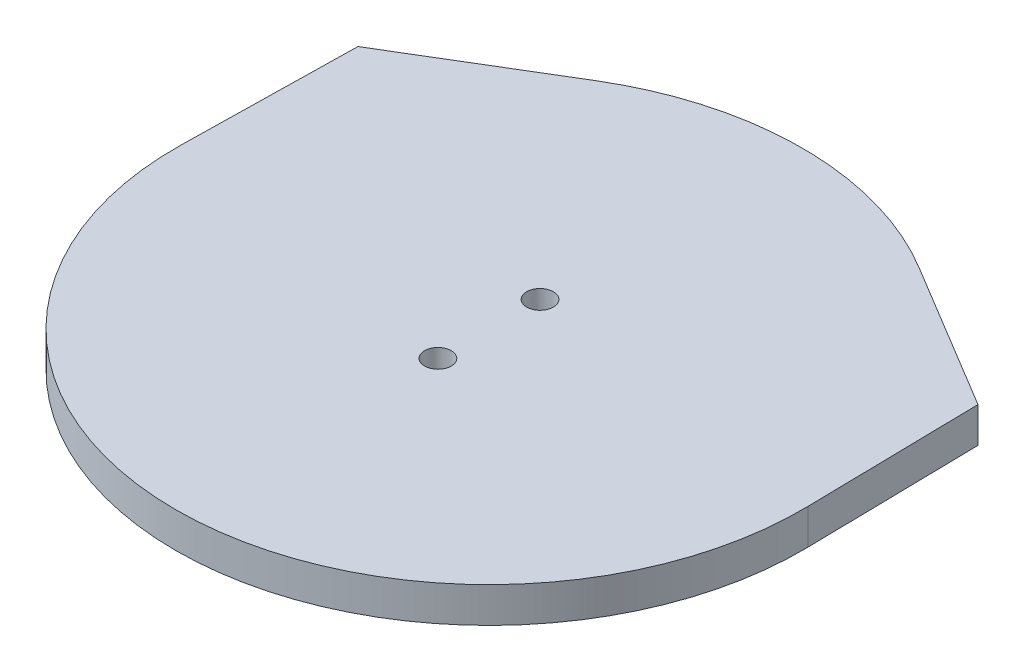
ISO-10303-21;
HEADER;
FILE_DESCRIPTION(('STEP AP214'),'2;1');
FILE_NAME('part.step','',(''),(''),'','','');
FILE_SCHEMA(('AUTOMOTIVE_DESIGN { 1 0 10303 214 1 1 1 1 }'));
ENDSEC;
DATA;
#1=APPLICATION_CONTEXT('core data for automotive mechanical design processes');
#2=APPLICATION_PROTOCOL_DEFINITION('international standard','automotive_design',2000,#1);
#3=PRODUCT_CONTEXT('',#1,'mechanical');
#4=PRODUCT('Part','Part','',(#3));
#5=PRODUCT_RELATED_PRODUCT_CATEGORY('part','',(#4));
#6=PRODUCT_DEFINITION_FORMATION('','',#4);
#7=PRODUCT_DEFINITION_CONTEXT('part definition',#1,'design');
#8=PRODUCT_DEFINITION('design','',#6,#7);
#9=PRODUCT_DEFINITION_SHAPE('','',#8);
#10=(LENGTH_UNIT() NAMED_UNIT(*) SI_UNIT(.MILLI.,.METRE.));
#11=(NAMED_UNIT(*) PLANE_ANGLE_UNIT() SI_UNIT($,.RADIAN.));
#12=(NAMED_UNIT(*) SI_UNIT($,.STERADIAN.) SOLID_ANGLE_UNIT());
#13=UNCERTAINTY_MEASURE_WITH_UNIT(LENGTH_MEASURE(1.E-05),#10,'distance_accuracy_value','');
#14=(GEOMETRIC_REPRESENTATION_CONTEXT(3) GLOBAL_UNCERTAINTY_ASSIGNED_CONTEXT((#13)) GLOBAL_UNIT_ASSIGNED_CONTEXT((#10,
#11,#12)) REPRESENTATION_CONTEXT('',''));
#15=CARTESIAN_POINT('',(0.,0.,0.));
#16=DIRECTION('',(0.,0.,1.));
#17=DIRECTION('',(1.,0.,0.));
#18=AXIS2_PLACEMENT_3D('',#15,#16,#17);
#19=CARTESIAN_POINT('',(-38.1373849926223,4.5,4.46913047330728));
#20=DIRECTION('',(0.999833687449352,0.,0.0182372542185591));
#21=DIRECTION('',(0.0182372542185591,0.,-0.999833687449352));
#22=AXIS2_PLACEMENT_3D('',#19,#20,#21);
#23=PLANE('',#22);
#24=DIRECTION('',(-0.0182372542185591,0.,0.999833687449352));
#25=VECTOR('',#24,1.);
#26=CARTESIAN_POINT('',(-38.1373849926223,0.,4.46913047330728));
#27=LINE('',#26,#25);
#28=CARTESIAN_POINT('',(-37.7350315351896,0.,-17.5893733004423));
#29=VERTEX_POINT('',#28);
#30=CARTESIAN_POINT('',(-38.1373849926223,0.,4.46913047330728));
#31=VERTEX_POINT('',#30);
#32=EDGE_CURVE('E117',#29,#31,#27,.T.);
#33=ORIENTED_EDGE('',*,*,#32,.T.);
#34=DIRECTION('',(0.,-1.,0.));
#35=VECTOR('',#34,1.);
#36=CARTESIAN_POINT('',(-38.1373849926223,4.5,4.46913047330728));
#37=LINE('',#36,#35);
#38=CARTESIAN_POINT('',(-38.1373849926223,4.5,4.46913047330728));
#39=VERTEX_POINT('',#38);
#40=EDGE_CURVE('E11',#39,#31,#37,.T.);
#41=ORIENTED_EDGE('',*,*,#40,.F.);
#42=DIRECTION('',(-0.0182372542185591,0.,0.999833687449352));
#43=VECTOR('',#42,1.);
#44=CARTESIAN_POINT('',(-38.1373849926223,4.5,4.46913047330728));
#45=LINE('',#44,#43);
#46=CARTESIAN_POINT('',(-37.7350315351896,4.5,-17.5893733004423));
#47=VERTEX_POINT('',#46);
#48=EDGE_CURVE('E128',#47,#39,#45,.T.);
#49=ORIENTED_EDGE('',*,*,#48,.F.);
#50=DIRECTION('',(0.,-1.,0.));
#51=VECTOR('',#50,1.);
#52=CARTESIAN_POINT('',(-37.7350315351896,4.5,-17.5893733004423));
#53=LINE('',#52,#51);
#54=EDGE_CURVE('E113',#47,#29,#53,.T.);
#55=ORIENTED_EDGE('',*,*,#54,.T.);
#56=EDGE_LOOP('',(#33,#41,#49,#55));
#57=FACE_BOUND('',#56,.T.);
#58=ADVANCED_FACE('F33',(#57),#23,.F.);
#59=CARTESIAN_POINT('',(1.73098329442058,4.5,5.19634098527287));
#60=DIRECTION('',(0.,-1.,0.));
#61=DIRECTION('',(0.,0.,-1.));
#62=AXIS2_PLACEMENT_3D('',#59,#60,#61);
#63=CYLINDRICAL_SURFACE('',#62,39.875);
#64=CARTESIAN_POINT('',(1.73098329442058,0.,5.19634098527287));
#65=DIRECTION('',(0.,1.,0.));
#66=DIRECTION('',(0.,0.,1.));
#67=AXIS2_PLACEMENT_3D('',#64,#65,#66);
#68=CIRCLE('',#67,39.875);
#69=CARTESIAN_POINT('',(41.5993515814632,0.,4.46913047329466));
#70=VERTEX_POINT('',#69);
#71=EDGE_CURVE('E120',#31,#70,#68,.T.);
#72=ORIENTED_EDGE('',*,*,#71,.T.);
#73=DIRECTION('',(0.,-1.,0.));
#74=VECTOR('',#73,1.);
#75=CARTESIAN_POINT('',(41.5993515814632,4.5,4.46913047329466));
#76=LINE('',#75,#74);
#77=CARTESIAN_POINT('',(41.5993515814632,4.5,4.46913047329466));
#78=VERTEX_POINT('',#77);
#79=EDGE_CURVE('E41',#78,#70,#76,.T.);
#80=ORIENTED_EDGE('',*,*,#79,.F.);
#81=CARTESIAN_POINT('',(1.73098329442058,4.5,5.19634098527287));
#82=DIRECTION('',(0.,1.,0.));
#83=DIRECTION('',(0.,0.,1.));
#84=AXIS2_PLACEMENT_3D('',#81,#82,#83);
#85=CIRCLE('',#84,39.875);
#86=EDGE_CURVE('E86',#39,#78,#85,.T.);
#87=ORIENTED_EDGE('',*,*,#86,.F.);
#88=ORIENTED_EDGE('',*,*,#40,.T.);
#89=EDGE_LOOP('',(#72,#80,#87,#88));
#90=FACE_BOUND('',#89,.T.);
#91=ADVANCED_FACE('F153',(#90),#63,.T.);
#92=CARTESIAN_POINT('',(41.1969981240235,4.5,-17.5893733004477));
#93=DIRECTION('',(-0.999833687449346,0.,0.018237254218887));
#94=DIRECTION('',(0.018237254218887,0.,0.999833687449346));
#95=AXIS2_PLACEMENT_3D('',#92,#93,#94);
#96=PLANE('',#95);
#97=DIRECTION('',(-0.018237254218887,0.,-0.999833687449346));
#98=VECTOR('',#97,1.);
#99=CARTESIAN_POINT('',(41.1969981240235,0.,-17.5893733004477));
#100=LINE('',#99,#98);
#101=CARTESIAN_POINT('',(41.1969981240235,0.,-17.5893733004477));
#102=VERTEX_POINT('',#101);
#103=EDGE_CURVE('E123',#70,#102,#100,.T.);
#104=ORIENTED_EDGE('',*,*,#103,.T.);
#105=DIRECTION('',(0.,-1.,0.));
#106=VECTOR('',#105,1.);
#107=CARTESIAN_POINT('',(41.1969981240235,4.5,-17.5893733004477));
#108=LINE('',#107,#106);
#109=CARTESIAN_POINT('',(41.1969981240235,4.5,-17.5893733004477));
#110=VERTEX_POINT('',#109);
#111=EDGE_CURVE('E108',#110,#102,#108,.T.);
#112=ORIENTED_EDGE('',*,*,#111,.F.);
#113=DIRECTION('',(-0.018237254218887,0.,-0.999833687449346));
#114=VECTOR('',#113,1.);
#115=CARTESIAN_POINT('',(41.1969981240235,4.5,-17.5893733004477));
#116=LINE('',#115,#114);
#117=EDGE_CURVE('E99',#78,#110,#116,.T.);
#118=ORIENTED_EDGE('',*,*,#117,.F.);
#119=ORIENTED_EDGE('',*,*,#79,.T.);
#120=EDGE_LOOP('',(#104,#112,#118,#119));
#121=FACE_BOUND('',#120,.T.);
#122=ADVANCED_FACE('F134',(#121),#96,.F.);
#123=CARTESIAN_POINT('',(41.1969981240235,4.5,-17.5893733004477));
#124=DIRECTION('',(-0.515710769173261,0.,0.856762745781306));
#125=DIRECTION('',(0.856762745781307,0.,0.515710769173261));
#126=AXIS2_PLACEMENT_3D('',#123,#124,#125);
#127=PLANE('',#126);
#128=DIRECTION('',(-0.856762745781306,0.,-0.515710769173261));
#129=VECTOR('',#128,1.);
#130=CARTESIAN_POINT('',(41.1969981240235,0.,-17.5893733004477));
#131=LINE('',#130,#129);
#132=CARTESIAN_POINT('',(22.2949502152044,0.,-28.9670735027568));
#133=VERTEX_POINT('',#132);
#134=EDGE_CURVE('E107',#102,#133,#131,.T.);
#135=ORIENTED_EDGE('',*,*,#134,.T.);
#136=DIRECTION('',(0.,-1.,0.));
#137=VECTOR('',#136,1.);
#138=CARTESIAN_POINT('',(22.2949502152044,4.5,-28.9670735027568));
#139=LINE('',#138,#137);
#140=CARTESIAN_POINT('',(22.2949502152044,4.5,-28.9670735027568));
#141=VERTEX_POINT('',#140);
#142=EDGE_CURVE('E104',#141,#133,#139,.T.);
#143=ORIENTED_EDGE('',*,*,#142,.F.);
#144=DIRECTION('',(-0.856762745781306,0.,-0.515710769173261));
#145=VECTOR('',#144,1.);
#146=CARTESIAN_POINT('',(41.1969981240235,4.5,-17.5893733004477));
#147=LINE('',#146,#145);
#148=EDGE_CURVE('E93',#110,#141,#147,.T.);
#149=ORIENTED_EDGE('',*,*,#148,.F.);
#150=ORIENTED_EDGE('',*,*,#111,.T.);
#151=EDGE_LOOP('',(#135,#143,#149,#150));
#152=FACE_BOUND('',#151,.T.);
#153=ADVANCED_FACE('F105',(#152),#127,.F.);
#154=CARTESIAN_POINT('',(1.73098329442058,4.5,5.19634098527275));
#155=DIRECTION('',(0.,-1.,0.));
#156=DIRECTION('',(0.,0.,-1.));
#157=AXIS2_PLACEMENT_3D('',#154,#155,#156);
#158=CYLINDRICAL_SURFACE('',#157,39.875);
#159=CARTESIAN_POINT('',(1.73098329442058,0.,5.19634098527275));
#160=DIRECTION('',(0.,1.,0.));
#161=DIRECTION('',(0.,0.,1.));
#162=AXIS2_PLACEMENT_3D('',#159,#160,#161);
#163=CIRCLE('',#162,39.875);
#164=CARTESIAN_POINT('',(-18.8329836263653,0.,-28.9670735027556));
#165=VERTEX_POINT('',#164);
#166=EDGE_CURVE('E72',#133,#165,#163,.T.);
#167=ORIENTED_EDGE('',*,*,#166,.T.);
#168=DIRECTION('',(0.,-1.,0.));
#169=VECTOR('',#168,1.);
#170=CARTESIAN_POINT('',(-18.8329836263653,4.5,-28.9670735027556));
#171=LINE('',#170,#169);
#172=CARTESIAN_POINT('',(-18.8329836263653,4.5,-28.9670735027556));
#173=VERTEX_POINT('',#172);
#174=EDGE_CURVE('E109',#173,#165,#171,.T.);
#175=ORIENTED_EDGE('',*,*,#174,.F.);
#176=CARTESIAN_POINT('',(1.73098329442058,4.5,5.19634098527275));
#177=DIRECTION('',(0.,1.,0.));
#178=DIRECTION('',(0.,0.,1.));
#179=AXIS2_PLACEMENT_3D('',#176,#177,#178);
#180=CIRCLE('',#179,39.875);
#181=EDGE_CURVE('E97',#141,#173,#180,.T.);
#182=ORIENTED_EDGE('',*,*,#181,.F.);
#183=ORIENTED_EDGE('',*,*,#142,.T.);
#184=EDGE_LOOP('',(#167,#175,#182,#183));
#185=FACE_BOUND('',#184,.T.);
#186=ADVANCED_FACE('F111',(#185),#158,.T.);
#187=CARTESIAN_POINT('',(-37.7350315351896,4.5,-17.5893733004423));
#188=DIRECTION('',(0.515710769173294,0.,0.856762745781287));
#189=DIRECTION('',(0.856762745781287,0.,-0.515710769173294));
#190=AXIS2_PLACEMENT_3D('',#187,#188,#189);
#191=PLANE('',#190);
#192=DIRECTION('',(-0.856762745781287,0.,0.515710769173294));
#193=VECTOR('',#192,1.);
#194=CARTESIAN_POINT('',(-37.7350315351896,0.,-17.5893733004423));
#195=LINE('',#194,#193);
#196=EDGE_CURVE('E78',#165,#29,#195,.T.);
#197=ORIENTED_EDGE('',*,*,#196,.T.);
#198=ORIENTED_EDGE('',*,*,#54,.F.);
#199=DIRECTION('',(-0.856762745781287,0.,0.515710769173294));
#200=VECTOR('',#199,1.);
#201=CARTESIAN_POINT('',(-37.7350315351896,4.5,-17.5893733004423));
#202=LINE('',#201,#200);
#203=EDGE_CURVE('E49',#173,#47,#202,.T.);
#204=ORIENTED_EDGE('',*,*,#203,.F.);
#205=ORIENTED_EDGE('',*,*,#174,.T.);
#206=EDGE_LOOP('',(#197,#198,#204,#205));
#207=FACE_BOUND('',#206,.T.);
#208=ADVANCED_FACE('F141',(#207),#191,.F.);
#209=CARTESIAN_POINT('',(1.73098329442058,4.5,5.19634098527275));
#210=DIRECTION('',(0.,1.,0.));
#211=DIRECTION('',(0.,0.,1.));
#212=AXIS2_PLACEMENT_3D('',#209,#210,#211);
#213=PLANE('',#212);
#214=CARTESIAN_POINT('',(1.73098329446182,4.5,-1.30365901475542));
#215=DIRECTION('',(0.,-1.,0.));
#216=DIRECTION('',(0.,0.,-1.));
#217=AXIS2_PLACEMENT_3D('',#214,#215,#216);
#218=CIRCLE('',#217,1.7);
#219=CARTESIAN_POINT('',(1.73098329446182,4.5,-3.00365901475541));
#220=VERTEX_POINT('',#219);
#221=EDGE_CURVE('E241',#220,#220,#218,.T.);
#222=ORIENTED_EDGE('',*,*,#221,.T.);
#223=EDGE_LOOP('',(#222));
#224=FACE_BOUND('',#223,.T.);
#225=CARTESIAN_POINT('',(1.73098329446182,4.5,11.6963409852446));
#226=DIRECTION('',(0.,-1.,0.));
#227=DIRECTION('',(0.,0.,-1.));
#228=AXIS2_PLACEMENT_3D('',#225,#226,#227);
#229=CIRCLE('',#228,1.7);
#230=CARTESIAN_POINT('',(1.73098329446182,4.5,9.99634098524459));
#231=VERTEX_POINT('',#230);
#232=EDGE_CURVE('E121',#231,#231,#229,.T.);
#233=ORIENTED_EDGE('',*,*,#232,.T.);
#234=EDGE_LOOP('',(#233));
#235=FACE_BOUND('',#234,.T.);
#236=ORIENTED_EDGE('',*,*,#48,.T.);
#237=ORIENTED_EDGE('',*,*,#86,.T.);
#238=ORIENTED_EDGE('',*,*,#117,.T.);
#239=ORIENTED_EDGE('',*,*,#148,.T.);
#240=ORIENTED_EDGE('',*,*,#181,.T.);
#241=ORIENTED_EDGE('',*,*,#203,.T.);
#242=EDGE_LOOP('',(#236,#237,#238,#239,#240,#241));
#243=FACE_BOUND('',#242,.T.);
#244=ADVANCED_FACE('F95',(#224,#235,#243),#213,.T.);
#245=CARTESIAN_POINT('',(1.73098329442058,0.,5.19634098527275));
#246=DIRECTION('',(0.,1.,0.));
#247=DIRECTION('',(0.,0.,1.));
#248=AXIS2_PLACEMENT_3D('',#245,#246,#247);
#249=PLANE('',#248);
#250=CARTESIAN_POINT('',(1.73098329446182,0.,-1.30365901475542));
#251=DIRECTION('',(0.,-1.,0.));
#252=DIRECTION('',(0.,0.,-1.));
#253=AXIS2_PLACEMENT_3D('',#250,#251,#252);
#254=CIRCLE('',#253,3.15);
#255=CARTESIAN_POINT('',(1.73098329446182,0.,-4.45365901475542));
#256=VERTEX_POINT('',#255);
#257=EDGE_CURVE('E239',#256,#256,#254,.T.);
#258=ORIENTED_EDGE('',*,*,#257,.F.);
#259=EDGE_LOOP('',(#258));
#260=FACE_BOUND('',#259,.T.);
#261=CARTESIAN_POINT('',(1.73098329446182,0.,11.6963409852446));
#262=DIRECTION('',(0.,-1.,0.));
#263=DIRECTION('',(0.,0.,-1.));
#264=AXIS2_PLACEMENT_3D('',#261,#262,#263);
#265=CIRCLE('',#264,3.15);
#266=CARTESIAN_POINT('',(1.73098329446182,0.,8.54634098524459));
#267=VERTEX_POINT('',#266);
#268=EDGE_CURVE('E246',#267,#267,#265,.T.);
#269=ORIENTED_EDGE('',*,*,#268,.F.);
#270=EDGE_LOOP('',(#269));
#271=FACE_BOUND('',#270,.T.);
#272=ORIENTED_EDGE('',*,*,#32,.F.);
#273=ORIENTED_EDGE('',*,*,#196,.F.);
#274=ORIENTED_EDGE('',*,*,#166,.F.);
#275=ORIENTED_EDGE('',*,*,#134,.F.);
#276=ORIENTED_EDGE('',*,*,#103,.F.);
#277=ORIENTED_EDGE('',*,*,#71,.F.);
#278=EDGE_LOOP('',(#272,#273,#274,#275,#276,#277));
#279=FACE_BOUND('',#278,.T.);
#280=ADVANCED_FACE('F137',(#260,#271,#279),#249,.F.);
#281=CARTESIAN_POINT('',(1.73098329446182,0.,11.6963409852446));
#282=DIRECTION('',(0.,-1.,0.));
#283=DIRECTION('',(0.,0.,-1.));
#284=AXIS2_PLACEMENT_3D('',#281,#282,#283);
#285=CYLINDRICAL_SURFACE('',#284,1.7);
#286=ORIENTED_EDGE('',*,*,#232,.F.);
#287=EDGE_LOOP('',(#286));
#288=FACE_BOUND('',#287,.T.);
#289=CARTESIAN_POINT('',(1.73098329446182,1.45,11.6963409852446));
#290=DIRECTION('',(0.,-1.,0.));
#291=DIRECTION('',(0.,0.,-1.));
#292=AXIS2_PLACEMENT_3D('',#289,#290,#291);
#293=CIRCLE('',#292,1.7);
#294=CARTESIAN_POINT('',(1.73098329446182,1.45,9.99634098524459));
#295=VERTEX_POINT('',#294);
#296=EDGE_CURVE('E249',#295,#295,#293,.T.);
#297=ORIENTED_EDGE('',*,*,#296,.T.);
#298=EDGE_LOOP('',(#297));
#299=FACE_BOUND('',#298,.T.);
#300=ADVANCED_FACE('F190',(#288,#299),#285,.F.);
#301=CARTESIAN_POINT('',(1.73098329446182,0.,11.6963409852446));
#302=DIRECTION('',(0.,-1.,0.));
#303=DIRECTION('',(0.,0.,-1.));
#304=AXIS2_PLACEMENT_3D('',#301,#302,#303);
#305=CONICAL_SURFACE('',#304,3.15,0.785398163397449);
#306=ORIENTED_EDGE('',*,*,#296,.F.);
#307=EDGE_LOOP('',(#306));
#308=FACE_BOUND('',#307,.T.);
#309=ORIENTED_EDGE('',*,*,#268,.T.);
#310=EDGE_LOOP('',(#309));
#311=FACE_BOUND('',#310,.T.);
#312=ADVANCED_FACE('F199',(#308,#311),#305,.F.);
#313=CARTESIAN_POINT('',(1.73098329446182,0.,-1.30365901475542));
#314=DIRECTION('',(0.,-1.,0.));
#315=DIRECTION('',(0.,0.,-1.));
#316=AXIS2_PLACEMENT_3D('',#313,#314,#315);
#317=CYLINDRICAL_SURFACE('',#316,1.7);
#318=ORIENTED_EDGE('',*,*,#221,.F.);
#319=EDGE_LOOP('',(#318));
#320=FACE_BOUND('',#319,.T.);
#321=CARTESIAN_POINT('',(1.73098329446182,1.45,-1.30365901475542));
#322=DIRECTION('',(0.,-1.,0.));
#323=DIRECTION('',(0.,0.,-1.));
#324=AXIS2_PLACEMENT_3D('',#321,#322,#323);
#325=CIRCLE('',#324,1.7);
#326=CARTESIAN_POINT('',(1.73098329446182,1.45,-3.00365901475541));
#327=VERTEX_POINT('',#326);
#328=EDGE_CURVE('E236',#327,#327,#325,.T.);
#329=ORIENTED_EDGE('',*,*,#328,.T.);
#330=EDGE_LOOP('',(#329));
#331=FACE_BOUND('',#330,.T.);
#332=ADVANCED_FACE('F209',(#320,#331),#317,.F.);
#333=CARTESIAN_POINT('',(1.73098329446182,0.,-1.30365901475542));
#334=DIRECTION('',(0.,-1.,0.));
#335=DIRECTION('',(0.,0.,-1.));
#336=AXIS2_PLACEMENT_3D('',#333,#334,#335);
#337=CONICAL_SURFACE('',#336,3.15,0.785398163397449);
#338=ORIENTED_EDGE('',*,*,#328,.F.);
#339=EDGE_LOOP('',(#338));
#340=FACE_BOUND('',#339,.T.);
#341=ORIENTED_EDGE('',*,*,#257,.T.);
#342=EDGE_LOOP('',(#341));
#343=FACE_BOUND('',#342,.T.);
#344=ADVANCED_FACE('F219',(#340,#343),#337,.F.);
#345=CLOSED_SHELL('',(#58,#91,#122,#153,#186,#208,#244,#280,#300,#312,#332,#344));
#346=MANIFOLD_SOLID_BREP('B2',#345);
#347=ADVANCED_BREP_SHAPE_REPRESENTATION('',(#18,#346),#14);
#348=SHAPE_DEFINITION_REPRESENTATION(#9,#347);
ENDSEC;
END-ISO-10303-21;
